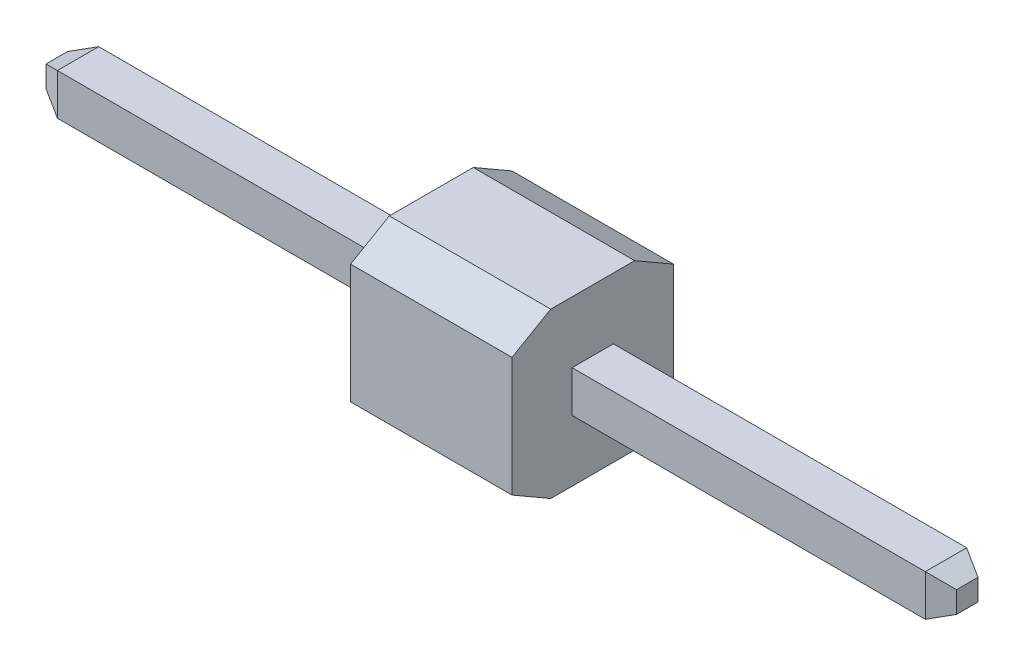
ISO-10303-21;
HEADER;
FILE_DESCRIPTION(('STEP AP214'),'2;1');
FILE_NAME('part.step','',(''),(''),'','','');
FILE_SCHEMA(('AUTOMOTIVE_DESIGN { 1 0 10303 214 1 1 1 1 }'));
ENDSEC;
DATA;
#1=APPLICATION_CONTEXT('core data for automotive mechanical design processes');
#2=APPLICATION_PROTOCOL_DEFINITION('international standard','automotive_design',2000,#1);
#3=PRODUCT_CONTEXT('',#1,'mechanical');
#4=PRODUCT('Part','Part','',(#3));
#5=PRODUCT_RELATED_PRODUCT_CATEGORY('part','',(#4));
#6=PRODUCT_DEFINITION_FORMATION('','',#4);
#7=PRODUCT_DEFINITION_CONTEXT('part definition',#1,'design');
#8=PRODUCT_DEFINITION('design','',#6,#7);
#9=PRODUCT_DEFINITION_SHAPE('','',#8);
#10=(LENGTH_UNIT() NAMED_UNIT(*) SI_UNIT(.MILLI.,.METRE.));
#11=(NAMED_UNIT(*) PLANE_ANGLE_UNIT() SI_UNIT($,.RADIAN.));
#12=(NAMED_UNIT(*) SI_UNIT($,.STERADIAN.) SOLID_ANGLE_UNIT());
#13=UNCERTAINTY_MEASURE_WITH_UNIT(LENGTH_MEASURE(1.E-05),#10,'distance_accuracy_value','');
#14=(GEOMETRIC_REPRESENTATION_CONTEXT(3) GLOBAL_UNCERTAINTY_ASSIGNED_CONTEXT((#13)) GLOBAL_UNIT_ASSIGNED_CONTEXT((#10,
#11,#12)) REPRESENTATION_CONTEXT('',''));
#15=CARTESIAN_POINT('',(0.,0.,0.));
#16=DIRECTION('',(0.,0.,1.));
#17=DIRECTION('',(1.,0.,0.));
#18=AXIS2_PLACEMENT_3D('',#15,#16,#17);
#19=CARTESIAN_POINT('',(5.42107538965371,-10.4771215871937,0.629998634255617));
#20=DIRECTION('',(1.,4.37113882867379E-08,-4.37113882867379E-08));
#21=DIRECTION('',(-4.37113882867379E-08,1.,0.));
#22=AXIS2_PLACEMENT_3D('',#19,#20,#21);
#23=PLANE('',#22);
#24=DIRECTION('',(1.59994777304463E-08,0.50000000000019,0.866025403784329));
#25=VECTOR('',#24,1.);
#26=CARTESIAN_POINT('',(5.4210752666678,-9.2335317487037,-0.940001365744382));
#27=LINE('',#26,#25);
#28=CARTESIAN_POINT('',(5.4210752666678,-9.2335317487037,-0.940001365744382));
#29=VERTEX_POINT('',#28);
#30=CARTESIAN_POINT('',(5.42107527775256,-8.8871215871937,-0.340001365744383));
#31=VERTEX_POINT('',#30);
#32=EDGE_CURVE('E11',#29,#31,#27,.T.);
#33=ORIENTED_EDGE('',*,*,#32,.T.);
#34=DIRECTION('',(4.37113886966664E-08,0.,0.999999999999999));
#35=VECTOR('',#34,1.);
#36=CARTESIAN_POINT('',(5.42107527775256,-8.8871215871937,-0.340001365744383));
#37=LINE('',#36,#35);
#38=CARTESIAN_POINT('',(5.42107533457736,-8.8871215871937,0.959998634255618));
#39=VERTEX_POINT('',#38);
#40=EDGE_CURVE('E304',#31,#39,#37,.T.);
#41=ORIENTED_EDGE('',*,*,#40,.T.);
#42=DIRECTION('',(5.97108668825761E-08,-0.500000000000186,0.86602540378433));
#43=VECTOR('',#42,1.);
#44=CARTESIAN_POINT('',(5.42107533457736,-8.8871215871937,0.959998634255618));
#45=LINE('',#44,#43);
#46=CARTESIAN_POINT('',(5.42107537594627,-9.23353174870369,1.55999863425562));
#47=VERTEX_POINT('',#46);
#48=EDGE_CURVE('E296',#39,#47,#45,.T.);
#49=ORIENTED_EDGE('',*,*,#48,.T.);
#50=DIRECTION('',(4.37113884815545E-08,-0.999999999999999,0.));
#51=VECTOR('',#50,1.);
#52=CARTESIAN_POINT('',(5.42107537594627,-9.23353174870369,1.55999863425562));
#53=LINE('',#52,#51);
#54=CARTESIAN_POINT('',(5.42107545668905,-11.0807114256737,1.55999863425562));
#55=VERTEX_POINT('',#54);
#56=EDGE_CURVE('E281',#47,#55,#53,.T.);
#57=ORIENTED_EDGE('',*,*,#56,.T.);
#58=DIRECTION('',(1.59994802942811E-08,0.500000000000192,0.866025403784328));
#59=VECTOR('',#58,1.);
#60=CARTESIAN_POINT('',(5.42107544560429,-11.4271215871937,0.959998634255618));
#61=LINE('',#60,#59);
#62=CARTESIAN_POINT('',(5.42107544560429,-11.4271215871937,0.959998634255618));
#63=VERTEX_POINT('',#62);
#64=EDGE_CURVE('E265',#63,#55,#61,.T.);
#65=ORIENTED_EDGE('',*,*,#64,.F.);
#66=DIRECTION('',(4.37113880134522E-08,0.,0.999999999999999));
#67=VECTOR('',#66,1.);
#68=CARTESIAN_POINT('',(5.42107538877949,-11.4271215871937,-0.340001365744383));
#69=LINE('',#68,#67);
#70=CARTESIAN_POINT('',(5.42107538877949,-11.4271215871937,-0.340001365744383));
#71=VERTEX_POINT('',#70);
#72=EDGE_CURVE('E248',#71,#63,#69,.T.);
#73=ORIENTED_EDGE('',*,*,#72,.F.);
#74=DIRECTION('',(5.97108656001701E-08,-0.500000000000187,0.866025403784328));
#75=VECTOR('',#74,1.);
#76=CARTESIAN_POINT('',(5.42107534741058,-11.0807114256737,-0.940001365744382));
#77=LINE('',#76,#75);
#78=CARTESIAN_POINT('',(5.42107534741058,-11.0807114256737,-0.940001365744382));
#79=VERTEX_POINT('',#78);
#80=EDGE_CURVE('E242',#79,#71,#77,.T.);
#81=ORIENTED_EDGE('',*,*,#80,.F.);
#82=DIRECTION('',(4.37113884815545E-08,-0.999999999999999,0.));
#83=VECTOR('',#82,1.);
#84=CARTESIAN_POINT('',(5.4210752666678,-9.2335317487037,-0.940001365744382));
#85=LINE('',#84,#83);
#86=EDGE_CURVE('E236',#29,#79,#85,.T.);
#87=ORIENTED_EDGE('',*,*,#86,.F.);
#88=EDGE_LOOP('',(#33,#41,#49,#57,#65,#73,#81,#87));
#89=FACE_BOUND('',#88,.T.);
#90=DIRECTION('',(-4.37113872875372E-08,0.,-0.999999999999999));
#91=VECTOR('',#90,1.);
#92=CARTESIAN_POINT('',(5.42107536167842,-9.8371215871937,0.629998634255617));
#93=LINE('',#92,#91);
#94=CARTESIAN_POINT('',(5.42107536167842,-9.8371215871937,0.629998634255617));
#95=VERTEX_POINT('',#94);
#96=CARTESIAN_POINT('',(5.42107533370314,-9.8371215871937,-0.0100013657443826));
#97=VERTEX_POINT('',#96);
#98=EDGE_CURVE('E302',#95,#97,#93,.T.);
#99=ORIENTED_EDGE('',*,*,#98,.T.);
#100=DIRECTION('',(-4.37113872875371E-08,0.999999999999999,0.));
#101=VECTOR('',#100,1.);
#102=CARTESIAN_POINT('',(5.42107536167842,-10.4771215871937,-0.0100013657443826));
#103=LINE('',#102,#101);
#104=CARTESIAN_POINT('',(5.42107536167842,-10.4771215871937,-0.0100013657443826));
#105=VERTEX_POINT('',#104);
#106=EDGE_CURVE('E293',#105,#97,#103,.T.);
#107=ORIENTED_EDGE('',*,*,#106,.F.);
#108=DIRECTION('',(-4.37113900630947E-08,0.,-0.999999999999999));
#109=VECTOR('',#108,1.);
#110=CARTESIAN_POINT('',(5.42107538965371,-10.4771215871937,0.629998634255617));
#111=LINE('',#110,#109);
#112=CARTESIAN_POINT('',(5.42107538965371,-10.4771215871937,0.629998634255617));
#113=VERTEX_POINT('',#112);
#114=EDGE_CURVE('E278',#113,#105,#111,.T.);
#115=ORIENTED_EDGE('',*,*,#114,.F.);
#116=DIRECTION('',(-4.37113900630947E-08,0.999999999999999,0.));
#117=VECTOR('',#116,1.);
#118=CARTESIAN_POINT('',(5.42107538965371,-10.4771215871937,0.629998634255617));
#119=LINE('',#118,#117);
#120=EDGE_CURVE('E263',#113,#95,#119,.T.);
#121=ORIENTED_EDGE('',*,*,#120,.T.);
#122=EDGE_LOOP('',(#99,#107,#115,#121));
#123=FACE_BOUND('',#122,.T.);
#124=ADVANCED_FACE('F17',(#89,#123),#23,.T.);
#125=CARTESIAN_POINT('',(2.92107538965371,-10.4771216964722,0.629998743534088));
#126=DIRECTION('',(1.,4.37113882867379E-08,-4.37113882867379E-08));
#127=DIRECTION('',(-4.37113882867379E-08,1.,0.));
#128=AXIS2_PLACEMENT_3D('',#125,#126,#127);
#129=PLANE('',#128);
#130=DIRECTION('',(1.59994783714339E-08,0.50000000000019,0.866025403784329));
#131=VECTOR('',#130,1.);
#132=CARTESIAN_POINT('',(2.9210752666678,-9.23353185798217,-0.940001256465912));
#133=LINE('',#132,#131);
#134=CARTESIAN_POINT('',(2.9210752666678,-9.23353185798217,-0.940001256465912));
#135=VERTEX_POINT('',#134);
#136=CARTESIAN_POINT('',(2.92107527775256,-8.88712169647217,-0.340001256465912));
#137=VERTEX_POINT('',#136);
#138=EDGE_CURVE('E24',#135,#137,#133,.T.);
#139=ORIENTED_EDGE('',*,*,#138,.F.);
#140=DIRECTION('',(4.37113882411397E-08,-0.999999999999999,0.));
#141=VECTOR('',#140,1.);
#142=CARTESIAN_POINT('',(2.9210752666678,-9.23353185798217,-0.940001256465912));
#143=LINE('',#142,#141);
#144=CARTESIAN_POINT('',(2.92107534741058,-11.0807115349522,-0.940001256465912));
#145=VERTEX_POINT('',#144);
#146=EDGE_CURVE('E300',#135,#145,#143,.T.);
#147=ORIENTED_EDGE('',*,*,#146,.T.);
#148=DIRECTION('',(5.97108668821452E-08,-0.500000000000187,0.866025403784328));
#149=VECTOR('',#148,1.);
#150=CARTESIAN_POINT('',(2.92107534741058,-11.0807115349522,-0.940001256465912));
#151=LINE('',#150,#149);
#152=CARTESIAN_POINT('',(2.92107538877949,-11.4271216964722,-0.340001256465912));
#153=VERTEX_POINT('',#152);
#154=EDGE_CURVE('E286',#145,#153,#151,.T.);
#155=ORIENTED_EDGE('',*,*,#154,.T.);
#156=DIRECTION('',(4.37113880134522E-08,0.,0.999999999999999));
#157=VECTOR('',#156,1.);
#158=CARTESIAN_POINT('',(2.92107538877949,-11.4271216964722,-0.340001256465912));
#159=LINE('',#158,#157);
#160=CARTESIAN_POINT('',(2.92107544560429,-11.4271216964722,0.959998743534088));
#161=VERTEX_POINT('',#160);
#162=EDGE_CURVE('E271',#153,#161,#159,.T.);
#163=ORIENTED_EDGE('',*,*,#162,.T.);
#164=DIRECTION('',(1.5999479012306E-08,0.500000000000192,0.866025403784328));
#165=VECTOR('',#164,1.);
#166=CARTESIAN_POINT('',(2.92107544560429,-11.4271216964722,0.959998743534088));
#167=LINE('',#166,#165);
#168=CARTESIAN_POINT('',(2.92107545668905,-11.0807115349522,1.55999874353409));
#169=VERTEX_POINT('',#168);
#170=EDGE_CURVE('E253',#161,#169,#167,.T.);
#171=ORIENTED_EDGE('',*,*,#170,.T.);
#172=DIRECTION('',(4.37113882411397E-08,-0.999999999999999,0.));
#173=VECTOR('',#172,1.);
#174=CARTESIAN_POINT('',(2.92107537594627,-9.23353185798216,1.55999874353409));
#175=LINE('',#174,#173);
#176=CARTESIAN_POINT('',(2.92107537594627,-9.23353185798216,1.55999874353409));
#177=VERTEX_POINT('',#176);
#178=EDGE_CURVE('E261',#177,#169,#175,.T.);
#179=ORIENTED_EDGE('',*,*,#178,.F.);
#180=DIRECTION('',(5.97108668825761E-08,-0.500000000000186,0.86602540378433));
#181=VECTOR('',#180,1.);
#182=CARTESIAN_POINT('',(2.92107533457736,-8.88712169647217,0.959998743534088));
#183=LINE('',#182,#181);
#184=CARTESIAN_POINT('',(2.92107533457736,-8.88712169647217,0.959998743534088));
#185=VERTEX_POINT('',#184);
#186=EDGE_CURVE('E276',#185,#177,#183,.T.);
#187=ORIENTED_EDGE('',*,*,#186,.F.);
#188=DIRECTION('',(4.37113883550593E-08,0.,0.999999999999999));
#189=VECTOR('',#188,1.);
#190=CARTESIAN_POINT('',(2.92107527775256,-8.88712169647217,-0.340001256465912));
#191=LINE('',#190,#189);
#192=EDGE_CURVE('E291',#137,#185,#191,.T.);
#193=ORIENTED_EDGE('',*,*,#192,.F.);
#194=EDGE_LOOP('',(#139,#147,#155,#163,#171,#179,#187,#193));
#195=FACE_BOUND('',#194,.T.);
#196=DIRECTION('',(-4.37113879814265E-08,0.999999999999999,0.));
#197=VECTOR('',#196,1.);
#198=CARTESIAN_POINT('',(2.92107536167842,-10.4771216964722,-0.0100012564659119));
#199=LINE('',#198,#197);
#200=CARTESIAN_POINT('',(2.92107536167842,-10.4771216964722,-0.0100012564659119));
#201=VERTEX_POINT('',#200);
#202=CARTESIAN_POINT('',(2.92107533370314,-9.83712169647217,-0.0100012564659119));
#203=VERTEX_POINT('',#202);
#204=EDGE_CURVE('E298',#201,#203,#199,.T.);
#205=ORIENTED_EDGE('',*,*,#204,.T.);
#206=DIRECTION('',(-4.37113879814266E-08,0.,-0.999999999999999));
#207=VECTOR('',#206,1.);
#208=CARTESIAN_POINT('',(2.92107536167842,-9.83712169647217,0.629998743534088));
#209=LINE('',#208,#207);
#210=CARTESIAN_POINT('',(2.92107536167842,-9.83712169647217,0.629998743534088));
#211=VERTEX_POINT('',#210);
#212=EDGE_CURVE('E283',#211,#203,#209,.T.);
#213=ORIENTED_EDGE('',*,*,#212,.F.);
#214=DIRECTION('',(-4.37113886753159E-08,0.999999999999999,0.));
#215=VECTOR('',#214,1.);
#216=CARTESIAN_POINT('',(2.92107538965371,-10.4771216964722,0.629998743534088));
#217=LINE('',#216,#215);
#218=CARTESIAN_POINT('',(2.92107538965371,-10.4771216964722,0.629998743534088));
#219=VERTEX_POINT('',#218);
#220=EDGE_CURVE('E268',#219,#211,#217,.T.);
#221=ORIENTED_EDGE('',*,*,#220,.F.);
#222=DIRECTION('',(-4.37113886753159E-08,0.,-0.999999999999999));
#223=VECTOR('',#222,1.);
#224=CARTESIAN_POINT('',(2.92107538965371,-10.4771216964722,0.629998743534088));
#225=LINE('',#224,#223);
#226=EDGE_CURVE('E251',#219,#201,#225,.T.);
#227=ORIENTED_EDGE('',*,*,#226,.T.);
#228=EDGE_LOOP('',(#205,#213,#221,#227));
#229=FACE_BOUND('',#228,.T.);
#230=ADVANCED_FACE('F314',(#195,#229),#129,.F.);
#231=CARTESIAN_POINT('',(5.4210752666678,-9.2335317487037,-0.940001365744382));
#232=DIRECTION('',(5.97108668343731E-08,-0.866025403784328,0.50000000000019));
#233=DIRECTION('',(-1.59994785476185E-08,-0.500000000000192,-0.866025403784329));
#234=AXIS2_PLACEMENT_3D('',#231,#232,#233);
#235=PLANE('',#234);
#236=ORIENTED_EDGE('',*,*,#138,.T.);
#237=DIRECTION('',(-0.999999999999998,-4.37113868656524E-08,4.37113883755557E-08));
#238=VECTOR('',#237,1.);
#239=CARTESIAN_POINT('',(5.42107527775256,-8.8871215871937,-0.340001365744383));
#240=LINE('',#239,#238);
#241=EDGE_CURVE('E288',#31,#137,#240,.T.);
#242=ORIENTED_EDGE('',*,*,#241,.F.);
#243=ORIENTED_EDGE('',*,*,#32,.F.);
#244=DIRECTION('',(-0.999999999999998,-4.37113897078233E-08,4.37113881091022E-08));
#245=VECTOR('',#244,1.);
#246=CARTESIAN_POINT('',(5.4210752666678,-9.2335317487037,-0.940001365744382));
#247=LINE('',#246,#245);
#248=EDGE_CURVE('E256',#29,#135,#247,.T.);
#249=ORIENTED_EDGE('',*,*,#248,.T.);
#250=EDGE_LOOP('',(#236,#242,#243,#249));
#251=FACE_BOUND('',#250,.T.);
#252=ADVANCED_FACE('F306',(#251),#235,.F.);
#253=CARTESIAN_POINT('',(5.42107527775256,-8.8871215871937,-0.340001365744383));
#254=DIRECTION('',(4.37113882867379E-08,-1.,0.));
#255=DIRECTION('',(1.,4.37113882867379E-08,-4.37113882867379E-08));
#256=AXIS2_PLACEMENT_3D('',#253,#254,#255);
#257=PLANE('',#256);
#258=ORIENTED_EDGE('',*,*,#192,.T.);
#259=DIRECTION('',(-0.999999999999998,-4.37113868656524E-08,4.37113882867378E-08));
#260=VECTOR('',#259,1.);
#261=CARTESIAN_POINT('',(5.42107533457736,-8.8871215871937,0.959998634255618));
#262=LINE('',#261,#260);
#263=EDGE_CURVE('E273',#39,#185,#262,.T.);
#264=ORIENTED_EDGE('',*,*,#263,.F.);
#265=ORIENTED_EDGE('',*,*,#40,.F.);
#266=ORIENTED_EDGE('',*,*,#241,.T.);
#267=EDGE_LOOP('',(#258,#264,#265,#266));
#268=FACE_BOUND('',#267,.T.);
#269=ADVANCED_FACE('F311',(#268),#257,.F.);
#270=CARTESIAN_POINT('',(5.42107533457736,-8.8871215871937,0.959998634255618));
#271=DIRECTION('',(1.59994785476185E-08,-0.86602540378433,-0.50000000000019));
#272=DIRECTION('',(-5.97108668343731E-08,0.500000000000188,-0.866025403784329));
#273=AXIS2_PLACEMENT_3D('',#270,#271,#272);
#274=PLANE('',#273);
#275=ORIENTED_EDGE('',*,*,#186,.T.);
#276=DIRECTION('',(-0.999999999999998,-4.37113897078233E-08,4.37113882867378E-08));
#277=VECTOR('',#276,1.);
#278=CARTESIAN_POINT('',(5.42107537594627,-9.23353174870369,1.55999863425562));
#279=LINE('',#278,#277);
#280=EDGE_CURVE('E258',#47,#177,#279,.T.);
#281=ORIENTED_EDGE('',*,*,#280,.F.);
#282=ORIENTED_EDGE('',*,*,#48,.F.);
#283=ORIENTED_EDGE('',*,*,#263,.T.);
#284=EDGE_LOOP('',(#275,#281,#282,#283));
#285=FACE_BOUND('',#284,.T.);
#286=ADVANCED_FACE('F319',(#285),#274,.F.);
#287=CARTESIAN_POINT('',(5.42107537594627,-9.23353174870369,1.55999863425562));
#288=DIRECTION('',(-4.37113882867379E-08,0.,-1.));
#289=DIRECTION('',(-1.,-4.37113882867379E-08,4.37113882867379E-08));
#290=AXIS2_PLACEMENT_3D('',#287,#288,#289);
#291=PLANE('',#290);
#292=ORIENTED_EDGE('',*,*,#178,.T.);
#293=DIRECTION('',(-0.999999999999998,-4.37113897078233E-08,4.37113882867378E-08));
#294=VECTOR('',#293,1.);
#295=CARTESIAN_POINT('',(5.42107545668905,-11.0807114256737,1.55999863425562));
#296=LINE('',#295,#294);
#297=EDGE_CURVE('E245',#55,#169,#296,.T.);
#298=ORIENTED_EDGE('',*,*,#297,.F.);
#299=ORIENTED_EDGE('',*,*,#56,.F.);
#300=ORIENTED_EDGE('',*,*,#280,.T.);
#301=EDGE_LOOP('',(#292,#298,#299,#300));
#302=FACE_BOUND('',#301,.T.);
#303=ADVANCED_FACE('F326',(#302),#291,.F.);
#304=CARTESIAN_POINT('',(5.42107544560429,-11.4271215871937,0.959998634255618));
#305=DIRECTION('',(5.97108668343731E-08,-0.866025403784328,0.50000000000019));
#306=DIRECTION('',(-1.59994785476185E-08,-0.500000000000192,-0.866025403784329));
#307=AXIS2_PLACEMENT_3D('',#304,#305,#306);
#308=PLANE('',#307);
#309=ORIENTED_EDGE('',*,*,#170,.F.);
#310=DIRECTION('',(-0.999999999999998,-4.37113897078233E-08,4.37113882867378E-08));
#311=VECTOR('',#310,1.);
#312=CARTESIAN_POINT('',(5.42107544560429,-11.4271215871937,0.959998634255618));
#313=LINE('',#312,#311);
#314=EDGE_CURVE('E239',#63,#161,#313,.T.);
#315=ORIENTED_EDGE('',*,*,#314,.F.);
#316=ORIENTED_EDGE('',*,*,#64,.T.);
#317=ORIENTED_EDGE('',*,*,#297,.T.);
#318=EDGE_LOOP('',(#309,#315,#316,#317));
#319=FACE_BOUND('',#318,.T.);
#320=ADVANCED_FACE('F329',(#319),#308,.T.);
#321=CARTESIAN_POINT('',(5.42107538877949,-11.4271215871937,-0.340001365744383));
#322=DIRECTION('',(4.37113882867379E-08,-1.,0.));
#323=DIRECTION('',(1.,4.37113882867379E-08,-4.37113882867379E-08));
#324=AXIS2_PLACEMENT_3D('',#321,#322,#323);
#325=PLANE('',#324);
#326=ORIENTED_EDGE('',*,*,#162,.F.);
#327=DIRECTION('',(-0.999999999999998,-4.37113897078233E-08,4.37113883755557E-08));
#328=VECTOR('',#327,1.);
#329=CARTESIAN_POINT('',(5.42107538877949,-11.4271215871937,-0.340001365744383));
#330=LINE('',#329,#328);
#331=EDGE_CURVE('E233',#71,#153,#330,.T.);
#332=ORIENTED_EDGE('',*,*,#331,.F.);
#333=ORIENTED_EDGE('',*,*,#72,.T.);
#334=ORIENTED_EDGE('',*,*,#314,.T.);
#335=EDGE_LOOP('',(#326,#332,#333,#334));
#336=FACE_BOUND('',#335,.T.);
#337=ADVANCED_FACE('F333',(#336),#325,.T.);
#338=CARTESIAN_POINT('',(5.42107534741058,-11.0807114256737,-0.940001365744382));
#339=DIRECTION('',(1.59994785476185E-08,-0.86602540378433,-0.50000000000019));
#340=DIRECTION('',(-5.97108668343731E-08,0.500000000000188,-0.866025403784329));
#341=AXIS2_PLACEMENT_3D('',#338,#339,#340);
#342=PLANE('',#341);
#343=ORIENTED_EDGE('',*,*,#154,.F.);
#344=DIRECTION('',(-0.999999999999998,-4.37113897078233E-08,4.37113881091021E-08));
#345=VECTOR('',#344,1.);
#346=CARTESIAN_POINT('',(5.42107534741058,-11.0807114256737,-0.940001365744382));
#347=LINE('',#346,#345);
#348=EDGE_CURVE('E230',#79,#145,#347,.T.);
#349=ORIENTED_EDGE('',*,*,#348,.F.);
#350=ORIENTED_EDGE('',*,*,#80,.T.);
#351=ORIENTED_EDGE('',*,*,#331,.T.);
#352=EDGE_LOOP('',(#343,#349,#350,#351));
#353=FACE_BOUND('',#352,.T.);
#354=ADVANCED_FACE('F337',(#353),#342,.T.);
#355=CARTESIAN_POINT('',(5.4210752666678,-9.2335317487037,-0.940001365744382));
#356=DIRECTION('',(-4.37113882867379E-08,0.,-1.));
#357=DIRECTION('',(-4.37113882867379E-08,1.,0.));
#358=AXIS2_PLACEMENT_3D('',#355,#356,#357);
#359=PLANE('',#358);
#360=ORIENTED_EDGE('',*,*,#146,.F.);
#361=ORIENTED_EDGE('',*,*,#248,.F.);
#362=ORIENTED_EDGE('',*,*,#86,.T.);
#363=ORIENTED_EDGE('',*,*,#348,.T.);
#364=EDGE_LOOP('',(#360,#361,#362,#363));
#365=FACE_BOUND('',#364,.T.);
#366=ADVANCED_FACE('F339',(#365),#359,.T.);
#367=CARTESIAN_POINT('',(-2.87892461034629,-10.4771219499982,0.62999899706014));
#368=DIRECTION('',(-1.,-4.37113882867379E-08,4.37113882867379E-08));
#369=DIRECTION('',(4.37113882867379E-08,-1.,0.));
#370=AXIS2_PLACEMENT_3D('',#367,#368,#369);
#371=PLANE('',#370);
#372=DIRECTION('',(4.37113927490808E-08,-0.999999999999999,0.));
#373=VECTOR('',#372,1.);
#374=CARTESIAN_POINT('',(-2.87892465284411,-9.99100347718822,0.14388052425114));
#375=LINE('',#374,#373);
#376=CARTESIAN_POINT('',(-2.87892465284411,-9.99100347718822,0.14388052425114));
#377=VERTEX_POINT('',#376);
#378=CARTESIAN_POINT('',(-2.87892463832158,-10.3232404227982,0.14388052425114));
#379=VERTEX_POINT('',#378);
#380=EDGE_CURVE('E228',#377,#379,#375,.T.);
#381=ORIENTED_EDGE('',*,*,#380,.T.);
#382=DIRECTION('',(4.37113874013716E-08,0.,0.999999999999999));
#383=VECTOR('',#382,1.);
#384=CARTESIAN_POINT('',(-2.87892463832158,-10.3232404227982,0.14388052425114));
#385=LINE('',#384,#383);
#386=CARTESIAN_POINT('',(-2.87892462379904,-10.3232404227982,0.47611746986914));
#387=VERTEX_POINT('',#386);
#388=EDGE_CURVE('E223',#379,#387,#385,.T.);
#389=ORIENTED_EDGE('',*,*,#388,.T.);
#390=DIRECTION('',(-4.37113900757526E-08,0.999999999999999,0.));
#391=VECTOR('',#390,1.);
#392=CARTESIAN_POINT('',(-2.87892462379904,-10.3232404227982,0.47611746986914));
#393=LINE('',#392,#391);
#394=CARTESIAN_POINT('',(-2.87892463832158,-9.99100347718822,0.47611746986914));
#395=VERTEX_POINT('',#394);
#396=EDGE_CURVE('E215',#387,#395,#393,.T.);
#397=ORIENTED_EDGE('',*,*,#396,.T.);
#398=DIRECTION('',(-4.37113847280434E-08,0.,-0.999999999999999));
#399=VECTOR('',#398,1.);
#400=CARTESIAN_POINT('',(-2.87892463832158,-9.99100347718822,0.47611746986914));
#401=LINE('',#400,#399);
#402=EDGE_CURVE('E207',#395,#377,#401,.T.);
#403=ORIENTED_EDGE('',*,*,#402,.T.);
#404=EDGE_LOOP('',(#381,#389,#397,#403));
#405=FACE_BOUND('',#404,.T.);
#406=ADVANCED_FACE('F341',(#405),#371,.T.);
#407=CARTESIAN_POINT('',(-2.87892461034629,-10.4771219499982,0.62999899706014));
#408=DIRECTION('',(4.37113882867379E-08,-1.,0.));
#409=DIRECTION('',(-4.37113882867379E-08,0.,-1.));
#410=AXIS2_PLACEMENT_3D('',#407,#408,#409);
#411=PLANE('',#410);
#412=DIRECTION('',(0.999999999999998,4.37113881958092E-08,-4.37113882769955E-08));
#413=VECTOR('',#412,1.);
#414=CARTESIAN_POINT('',(-2.54892461034629,-10.4771219355735,0.629998982635382));
#415=LINE('',#414,#413);
#416=CARTESIAN_POINT('',(-2.54892461034629,-10.4771219355735,0.629998982635382));
#417=VERTEX_POINT('',#416);
#418=EDGE_CURVE('E225',#417,#219,#415,.T.);
#419=ORIENTED_EDGE('',*,*,#418,.F.);
#420=DIRECTION('',(-4.37113872875372E-08,0.,-0.999999999999999));
#421=VECTOR('',#420,1.);
#422=CARTESIAN_POINT('',(-2.54892461034629,-10.4771219355735,0.629998982635382));
#423=LINE('',#422,#421);
#424=CARTESIAN_POINT('',(-2.54892463832157,-10.4771219355735,-0.010001017364618));
#425=VERTEX_POINT('',#424);
#426=EDGE_CURVE('E217',#417,#425,#423,.T.);
#427=ORIENTED_EDGE('',*,*,#426,.T.);
#428=DIRECTION('',(0.999999999999998,4.37113881958092E-08,-4.37113882161058E-08));
#429=VECTOR('',#428,1.);
#430=CARTESIAN_POINT('',(-2.54892463832157,-10.4771219355735,-0.010001017364618));
#431=LINE('',#430,#429);
#432=EDGE_CURVE('E220',#425,#201,#431,.T.);
#433=ORIENTED_EDGE('',*,*,#432,.T.);
#434=ORIENTED_EDGE('',*,*,#226,.F.);
#435=EDGE_LOOP('',(#419,#427,#433,#434));
#436=FACE_BOUND('',#435,.T.);
#437=ADVANCED_FACE('F348',(#436),#411,.T.);
#438=CARTESIAN_POINT('',(-2.87892463832158,-10.4771219499982,-0.0100010029398598));
#439=DIRECTION('',(-4.37113882867379E-08,0.,-1.));
#440=DIRECTION('',(-1.,-4.37113882867379E-08,4.37113882867379E-08));
#441=AXIS2_PLACEMENT_3D('',#438,#439,#440);
#442=PLANE('',#441);
#443=ORIENTED_EDGE('',*,*,#432,.F.);
#444=DIRECTION('',(-4.37113886753159E-08,0.999999999999999,0.));
#445=VECTOR('',#444,1.);
#446=CARTESIAN_POINT('',(-2.54892463832157,-10.4771219355735,-0.010001017364618));
#447=LINE('',#446,#445);
#448=CARTESIAN_POINT('',(-2.54892466629686,-9.83712193557346,-0.010001017364618));
#449=VERTEX_POINT('',#448);
#450=EDGE_CURVE('E209',#425,#449,#447,.T.);
#451=ORIENTED_EDGE('',*,*,#450,.T.);
#452=DIRECTION('',(0.999999999999998,4.37113907937716E-08,-4.37113882161057E-08));
#453=VECTOR('',#452,1.);
#454=CARTESIAN_POINT('',(-2.54892466629686,-9.83712193557346,-0.010001017364618));
#455=LINE('',#454,#453);
#456=EDGE_CURVE('E212',#449,#203,#455,.T.);
#457=ORIENTED_EDGE('',*,*,#456,.T.);
#458=ORIENTED_EDGE('',*,*,#204,.F.);
#459=EDGE_LOOP('',(#443,#451,#457,#458));
#460=FACE_BOUND('',#459,.T.);
#461=ADVANCED_FACE('F424',(#460),#442,.T.);
#462=CARTESIAN_POINT('',(-2.87892463832158,-9.83712194999822,0.62999899706014));
#463=DIRECTION('',(4.37113882867379E-08,-1.,0.));
#464=DIRECTION('',(-4.37113882867379E-08,0.,-1.));
#465=AXIS2_PLACEMENT_3D('',#462,#463,#464);
#466=PLANE('',#465);
#467=ORIENTED_EDGE('',*,*,#456,.F.);
#468=DIRECTION('',(4.37113900630947E-08,0.,0.999999999999999));
#469=VECTOR('',#468,1.);
#470=CARTESIAN_POINT('',(-2.54892466629686,-9.83712193557347,-0.010001017364618));
#471=LINE('',#470,#469);
#472=CARTESIAN_POINT('',(-2.54892463832157,-9.83712193557346,0.629998982635382));
#473=VERTEX_POINT('',#472);
#474=EDGE_CURVE('E201',#449,#473,#471,.T.);
#475=ORIENTED_EDGE('',*,*,#474,.T.);
#476=DIRECTION('',(0.999999999999998,4.37113907937716E-08,-4.37113882769955E-08));
#477=VECTOR('',#476,1.);
#478=CARTESIAN_POINT('',(-2.54892463832157,-9.83712193557346,0.629998982635382));
#479=LINE('',#478,#477);
#480=EDGE_CURVE('E204',#473,#211,#479,.T.);
#481=ORIENTED_EDGE('',*,*,#480,.T.);
#482=ORIENTED_EDGE('',*,*,#212,.T.);
#483=EDGE_LOOP('',(#467,#475,#481,#482));
#484=FACE_BOUND('',#483,.T.);
#485=ADVANCED_FACE('F421',(#484),#466,.F.);
#486=CARTESIAN_POINT('',(-2.87892461034629,-10.4771219499982,0.62999899706014));
#487=DIRECTION('',(-4.37113882867379E-08,0.,-1.));
#488=DIRECTION('',(-1.,-4.37113882867379E-08,4.37113882867379E-08));
#489=AXIS2_PLACEMENT_3D('',#486,#487,#488);
#490=PLANE('',#489);
#491=ORIENTED_EDGE('',*,*,#480,.F.);
#492=DIRECTION('',(4.37113858997586E-08,-0.999999999999999,0.));
#493=VECTOR('',#492,1.);
#494=CARTESIAN_POINT('',(-2.54892463832157,-9.83712193557346,0.629998982635382));
#495=LINE('',#494,#493);
#496=EDGE_CURVE('E196',#473,#417,#495,.T.);
#497=ORIENTED_EDGE('',*,*,#496,.T.);
#498=ORIENTED_EDGE('',*,*,#418,.T.);
#499=ORIENTED_EDGE('',*,*,#220,.T.);
#500=EDGE_LOOP('',(#491,#497,#498,#499));
#501=FACE_BOUND('',#500,.T.);
#502=ADVANCED_FACE('F376',(#501),#490,.F.);
#503=CARTESIAN_POINT('',(-2.87892461034629,-10.4771219499982,0.62999899706014));
#504=DIRECTION('',(-4.37113882867379E-08,0.,-1.));
#505=DIRECTION('',(-1.,-4.37113882867379E-08,4.37113882867379E-08));
#506=AXIS2_PLACEMENT_3D('',#503,#504,#505);
#507=PLANE('',#506);
#508=DIRECTION('',(0.999999999999998,4.37113829998842E-08,-4.37113882769955E-08));
#509=VECTOR('',#508,1.);
#510=CARTESIAN_POINT('',(5.42107538965371,-10.4771215871937,0.629998634255617));
#511=LINE('',#510,#509);
#512=CARTESIAN_POINT('',(10.8910753896537,-10.4771213480924,0.629998395154324));
#513=VERTEX_POINT('',#512);
#514=EDGE_CURVE('E199',#113,#513,#511,.T.);
#515=ORIENTED_EDGE('',*,*,#514,.T.);
#516=DIRECTION('',(-4.37113872875371E-08,0.999999999999999,0.));
#517=VECTOR('',#516,1.);
#518=CARTESIAN_POINT('',(10.8910753896537,-10.4771213480924,0.629998395154324));
#519=LINE('',#518,#517);
#520=CARTESIAN_POINT('',(10.8910753616784,-9.8371213480924,0.629998395154324));
#521=VERTEX_POINT('',#520);
#522=EDGE_CURVE('E191',#513,#521,#519,.T.);
#523=ORIENTED_EDGE('',*,*,#522,.T.);
#524=DIRECTION('',(0.999999999999998,4.37113933917341E-08,-4.37113882769955E-08));
#525=VECTOR('',#524,1.);
#526=CARTESIAN_POINT('',(5.42107536167842,-9.8371215871937,0.629998634255617));
#527=LINE('',#526,#525);
#528=EDGE_CURVE('E194',#95,#521,#527,.T.);
#529=ORIENTED_EDGE('',*,*,#528,.F.);
#530=ORIENTED_EDGE('',*,*,#120,.F.);
#531=EDGE_LOOP('',(#515,#523,#529,#530));
#532=FACE_BOUND('',#531,.T.);
#533=ADVANCED_FACE('F367',(#532),#507,.F.);
#534=CARTESIAN_POINT('',(-2.87892463832158,-9.83712194999822,0.62999899706014));
#535=DIRECTION('',(4.37113882867379E-08,-1.,0.));
#536=DIRECTION('',(-4.37113882867379E-08,0.,-1.));
#537=AXIS2_PLACEMENT_3D('',#534,#535,#536);
#538=PLANE('',#537);
#539=ORIENTED_EDGE('',*,*,#528,.T.);
#540=DIRECTION('',(-4.37113900630947E-08,0.,-0.999999999999999));
#541=VECTOR('',#540,1.);
#542=CARTESIAN_POINT('',(10.8910753616784,-9.8371213480924,0.629998395154324));
#543=LINE('',#542,#541);
#544=CARTESIAN_POINT('',(10.8910753337031,-9.8371213480924,-0.0100016048456765));
#545=VERTEX_POINT('',#544);
#546=EDGE_CURVE('E186',#521,#545,#543,.T.);
#547=ORIENTED_EDGE('',*,*,#546,.T.);
#548=DIRECTION('',(0.999999999999998,4.37113933917341E-08,-4.37113881146228E-08));
#549=VECTOR('',#548,1.);
#550=CARTESIAN_POINT('',(5.42107533370314,-9.8371215871937,-0.0100013657443823));
#551=LINE('',#550,#549);
#552=EDGE_CURVE('E189',#97,#545,#551,.T.);
#553=ORIENTED_EDGE('',*,*,#552,.F.);
#554=ORIENTED_EDGE('',*,*,#98,.F.);
#555=EDGE_LOOP('',(#539,#547,#553,#554));
#556=FACE_BOUND('',#555,.T.);
#557=ADVANCED_FACE('F364',(#556),#538,.F.);
#558=CARTESIAN_POINT('',(-2.87892463832158,-10.4771219499982,-0.0100010029398598));
#559=DIRECTION('',(-4.37113882867379E-08,0.,-1.));
#560=DIRECTION('',(-1.,-4.37113882867379E-08,4.37113882867379E-08));
#561=AXIS2_PLACEMENT_3D('',#558,#559,#560);
#562=PLANE('',#561);
#563=ORIENTED_EDGE('',*,*,#552,.T.);
#564=DIRECTION('',(4.37113900630949E-08,-0.999999999999999,0.));
#565=VECTOR('',#564,1.);
#566=CARTESIAN_POINT('',(10.8910753337031,-9.83712134809241,-0.0100016048456764));
#567=LINE('',#566,#565);
#568=CARTESIAN_POINT('',(10.8910753616784,-10.4771213480924,-0.0100016048456765));
#569=VERTEX_POINT('',#568);
#570=EDGE_CURVE('E176',#545,#569,#567,.T.);
#571=ORIENTED_EDGE('',*,*,#570,.T.);
#572=DIRECTION('',(0.999999999999998,4.37113829998842E-08,-4.37113881146228E-08));
#573=VECTOR('',#572,1.);
#574=CARTESIAN_POINT('',(5.42107536167842,-10.4771215871937,-0.0100013657443823));
#575=LINE('',#574,#573);
#576=EDGE_CURVE('E179',#105,#569,#575,.T.);
#577=ORIENTED_EDGE('',*,*,#576,.F.);
#578=ORIENTED_EDGE('',*,*,#106,.T.);
#579=EDGE_LOOP('',(#563,#571,#577,#578));
#580=FACE_BOUND('',#579,.T.);
#581=ADVANCED_FACE('F366',(#580),#562,.T.);
#582=CARTESIAN_POINT('',(-2.87892461034629,-10.4771219499982,0.62999899706014));
#583=DIRECTION('',(4.37113882867379E-08,-1.,0.));
#584=DIRECTION('',(-4.37113882867379E-08,0.,-1.));
#585=AXIS2_PLACEMENT_3D('',#582,#583,#584);
#586=PLANE('',#585);
#587=ORIENTED_EDGE('',*,*,#576,.T.);
#588=DIRECTION('',(4.37113872875372E-08,0.,0.999999999999999));
#589=VECTOR('',#588,1.);
#590=CARTESIAN_POINT('',(10.8910753616784,-10.4771213480924,-0.0100016048456765));
#591=LINE('',#590,#589);
#592=EDGE_CURVE('E167',#569,#513,#591,.T.);
#593=ORIENTED_EDGE('',*,*,#592,.T.);
#594=ORIENTED_EDGE('',*,*,#514,.F.);
#595=ORIENTED_EDGE('',*,*,#114,.T.);
#596=EDGE_LOOP('',(#587,#593,#594,#595));
#597=FACE_BOUND('',#596,.T.);
#598=ADVANCED_FACE('F373',(#597),#586,.T.);
#599=CARTESIAN_POINT('',(11.2210753896537,-10.4771213336676,0.629998380729565));
#600=DIRECTION('',(-1.,-4.37113882867379E-08,4.37113882867379E-08));
#601=DIRECTION('',(4.37113882867379E-08,-1.,0.));
#602=AXIS2_PLACEMENT_3D('',#599,#600,#601);
#603=PLANE('',#602);
#604=DIRECTION('',(-4.37113874024243E-08,0.999999999999999,0.));
#605=VECTOR('',#604,1.);
#606=CARTESIAN_POINT('',(11.2210753616784,-10.3232398064676,0.143879907920565));
#607=LINE('',#606,#605);
#608=CARTESIAN_POINT('',(11.2210753616784,-10.3232398064676,0.143879907920565));
#609=VERTEX_POINT('',#608);
#610=CARTESIAN_POINT('',(11.2210753471559,-9.99100286085764,0.143879907920565));
#611=VERTEX_POINT('',#610);
#612=EDGE_CURVE('E153',#609,#611,#607,.T.);
#613=ORIENTED_EDGE('',*,*,#612,.T.);
#614=DIRECTION('',(4.37113874013716E-08,0.,0.999999999999999));
#615=VECTOR('',#614,1.);
#616=CARTESIAN_POINT('',(11.2210753471559,-9.99100286085765,0.143879907920565));
#617=LINE('',#616,#615);
#618=CARTESIAN_POINT('',(11.2210753616784,-9.99100286085764,0.476116853538565));
#619=VERTEX_POINT('',#618);
#620=EDGE_CURVE('E395',#611,#619,#617,.T.);
#621=ORIENTED_EDGE('',*,*,#620,.T.);
#622=DIRECTION('',(4.37113874024243E-08,-0.999999999999999,0.));
#623=VECTOR('',#622,1.);
#624=CARTESIAN_POINT('',(11.2210753616784,-9.99100286085764,0.476116853538565));
#625=LINE('',#624,#623);
#626=CARTESIAN_POINT('',(11.221075376201,-10.3232398064676,0.476116853538565));
#627=VERTEX_POINT('',#626);
#628=EDGE_CURVE('E156',#619,#627,#625,.T.);
#629=ORIENTED_EDGE('',*,*,#628,.T.);
#630=DIRECTION('',(-4.37113927480282E-08,0.,-0.999999999999999));
#631=VECTOR('',#630,1.);
#632=CARTESIAN_POINT('',(11.221075376201,-10.3232398064676,0.476116853538565));
#633=LINE('',#632,#631);
#634=EDGE_CURVE('E149',#627,#609,#633,.T.);
#635=ORIENTED_EDGE('',*,*,#634,.T.);
#636=EDGE_LOOP('',(#613,#621,#629,#635));
#637=FACE_BOUND('',#636,.T.);
#638=ADVANCED_FACE('F151',(#637),#603,.F.);
#639=CARTESIAN_POINT('',(-2.8789246315952,-9.99100347718822,0.62999899706014));
#640=DIRECTION('',(-0.422618301356784,0.906307768563367,1.84732310895534E-08));
#641=DIRECTION('',(4.37113882867379E-08,0.,1.));
#642=AXIS2_PLACEMENT_3D('',#639,#640,#641);
#643=PLANE('',#642);
#644=DIRECTION('',(0.834817095446925,0.38928165712602,-0.389281657126018));
#645=VECTOR('',#644,1.);
#646=CARTESIAN_POINT('',(-2.87892465284413,-9.9910034771877,0.143880524251623));
#647=LINE('',#646,#645);
#648=EDGE_CURVE('E181',#377,#449,#647,.T.);
#649=ORIENTED_EDGE('',*,*,#648,.F.);
#650=ORIENTED_EDGE('',*,*,#402,.F.);
#651=DIRECTION('',(-0.834817129479007,-0.389281657126019,-0.389281584143986));
#652=VECTOR('',#651,1.);
#653=CARTESIAN_POINT('',(-2.548924638322,-9.837121935572,0.629998982634844));
#654=LINE('',#653,#652);
#655=EDGE_CURVE('E404',#473,#395,#654,.T.);
#656=ORIENTED_EDGE('',*,*,#655,.F.);
#657=ORIENTED_EDGE('',*,*,#474,.F.);
#658=EDGE_LOOP('',(#649,#650,#656,#657));
#659=FACE_BOUND('',#658,.T.);
#660=ADVANCED_FACE('F418',(#659),#643,.T.);
#661=CARTESIAN_POINT('',(-2.87892461707266,-10.4771219499982,0.47611746986914));
#662=DIRECTION('',(-0.422618222124841,-1.84732292043498E-08,0.906307805509828));
#663=DIRECTION('',(4.37113882867379E-08,-1.,0.));
#664=AXIS2_PLACEMENT_3D('',#661,#662,#663);
#665=PLANE('',#664);
#666=ORIENTED_EDGE('',*,*,#655,.T.);
#667=ORIENTED_EDGE('',*,*,#396,.F.);
#668=DIRECTION('',(-0.834817163511087,0.389281584143985,-0.389281584143987));
#669=VECTOR('',#668,1.);
#670=CARTESIAN_POINT('',(-2.54892461034514,-10.4771219355707,0.629998982635654));
#671=LINE('',#670,#669);
#672=EDGE_CURVE('E160',#417,#387,#671,.T.);
#673=ORIENTED_EDGE('',*,*,#672,.F.);
#674=ORIENTED_EDGE('',*,*,#496,.F.);
#675=EDGE_LOOP('',(#666,#667,#673,#674));
#676=FACE_BOUND('',#675,.T.);
#677=ADVANCED_FACE('F434',(#676),#665,.T.);
#678=CARTESIAN_POINT('',(-2.54892463832157,-10.4771219355735,-0.010001017364618));
#679=DIRECTION('',(0.422618301356784,1.8473232667688E-08,0.906307768563367));
#680=DIRECTION('',(-4.37113882867379E-08,1.,0.));
#681=AXIS2_PLACEMENT_3D('',#678,#679,#680);
#682=PLANE('',#681);
#683=ORIENTED_EDGE('',*,*,#648,.T.);
#684=ORIENTED_EDGE('',*,*,#450,.F.);
#685=DIRECTION('',(0.834817129479008,-0.389281584143985,-0.389281657126018));
#686=VECTOR('',#685,1.);
#687=CARTESIAN_POINT('',(-2.87892463832441,-10.3232404228058,0.1438805242526));
#688=LINE('',#687,#686);
#689=EDGE_CURVE('E170',#379,#425,#688,.T.);
#690=ORIENTED_EDGE('',*,*,#689,.F.);
#691=ORIENTED_EDGE('',*,*,#380,.F.);
#692=EDGE_LOOP('',(#683,#684,#690,#691));
#693=FACE_BOUND('',#692,.T.);
#694=ADVANCED_FACE('F413',(#693),#682,.F.);
#695=CARTESIAN_POINT('',(-2.54892461034629,-10.4771219355735,0.629998982635382));
#696=DIRECTION('',(0.422618222124841,0.906307805509828,-1.84732308250282E-08));
#697=DIRECTION('',(-4.37113882867379E-08,0.,-1.));
#698=AXIS2_PLACEMENT_3D('',#695,#696,#697);
#699=PLANE('',#698);
#700=ORIENTED_EDGE('',*,*,#672,.T.);
#701=ORIENTED_EDGE('',*,*,#388,.F.);
#702=ORIENTED_EDGE('',*,*,#689,.T.);
#703=ORIENTED_EDGE('',*,*,#426,.F.);
#704=EDGE_LOOP('',(#700,#701,#702,#703));
#705=FACE_BOUND('',#704,.T.);
#706=ADVANCED_FACE('F429',(#705),#699,.F.);
#707=CARTESIAN_POINT('',(11.2210753829273,-10.3232398064676,0.629998380729565));
#708=DIRECTION('',(0.422618301356784,-0.906307768563367,-1.84732310470096E-08));
#709=DIRECTION('',(4.37113882867379E-08,0.,1.));
#710=AXIS2_PLACEMENT_3D('',#707,#708,#709);
#711=PLANE('',#710);
#712=DIRECTION('',(-0.834817129479003,-0.389281657126027,-0.389281584143988));
#713=VECTOR('',#712,1.);
#714=CARTESIAN_POINT('',(11.2210753616784,-10.3232398064682,0.143879907921048));
#715=LINE('',#714,#713);
#716=EDGE_CURVE('E164',#609,#569,#715,.T.);
#717=ORIENTED_EDGE('',*,*,#716,.F.);
#718=ORIENTED_EDGE('',*,*,#634,.F.);
#719=DIRECTION('',(0.834817095446923,0.389281657126025,-0.389281657126018));
#720=VECTOR('',#719,1.);
#721=CARTESIAN_POINT('',(10.8910753896537,-10.4771213480924,0.629998395154324));
#722=LINE('',#721,#720);
#723=EDGE_CURVE('E392',#513,#627,#722,.T.);
#724=ORIENTED_EDGE('',*,*,#723,.F.);
#725=ORIENTED_EDGE('',*,*,#592,.F.);
#726=EDGE_LOOP('',(#717,#718,#724,#725));
#727=FACE_BOUND('',#726,.T.);
#728=ADVANCED_FACE('F165',(#727),#711,.T.);
#729=CARTESIAN_POINT('',(10.8910753896537,-10.4771213480924,0.629998395154324));
#730=DIRECTION('',(-0.422618301356784,-1.8473232667688E-08,-0.906307768563367));
#731=DIRECTION('',(-4.37113882867379E-08,1.,0.));
#732=AXIS2_PLACEMENT_3D('',#729,#730,#731);
#733=PLANE('',#732);
#734=ORIENTED_EDGE('',*,*,#723,.T.);
#735=ORIENTED_EDGE('',*,*,#628,.F.);
#736=DIRECTION('',(0.834817129479006,-0.389281584143989,-0.38928165712602));
#737=VECTOR('',#736,1.);
#738=CARTESIAN_POINT('',(10.89107536168,-9.8371213480882,0.629998395153421));
#739=LINE('',#738,#737);
#740=EDGE_CURVE('E389',#521,#619,#739,.T.);
#741=ORIENTED_EDGE('',*,*,#740,.F.);
#742=ORIENTED_EDGE('',*,*,#522,.F.);
#743=EDGE_LOOP('',(#734,#735,#741,#742));
#744=FACE_BOUND('',#743,.T.);
#745=ADVANCED_FACE('F390',(#744),#733,.F.);
#746=CARTESIAN_POINT('',(11.2210753684048,-10.4771213336676,0.143879907920565));
#747=DIRECTION('',(0.422618222124841,1.84732292043498E-08,-0.906307805509828));
#748=DIRECTION('',(4.37113882867379E-08,-1.,0.));
#749=AXIS2_PLACEMENT_3D('',#746,#747,#748);
#750=PLANE('',#749);
#751=ORIENTED_EDGE('',*,*,#716,.T.);
#752=ORIENTED_EDGE('',*,*,#570,.F.);
#753=DIRECTION('',(-0.834817163511088,0.389281584143981,-0.389281584143989));
#754=VECTOR('',#753,1.);
#755=CARTESIAN_POINT('',(11.2210753471559,-9.99100286085713,0.143879907921048));
#756=LINE('',#755,#754);
#757=EDGE_CURVE('E175',#611,#545,#756,.T.);
#758=ORIENTED_EDGE('',*,*,#757,.F.);
#759=ORIENTED_EDGE('',*,*,#612,.F.);
#760=EDGE_LOOP('',(#751,#752,#758,#759));
#761=FACE_BOUND('',#760,.T.);
#762=ADVANCED_FACE('F173',(#761),#750,.T.);
#763=CARTESIAN_POINT('',(10.8910753616784,-9.8371213480924,0.629998395154324));
#764=DIRECTION('',(-0.422618222124841,-0.906307805509828,1.84732307824844E-08));
#765=DIRECTION('',(-4.37113882867379E-08,0.,-1.));
#766=AXIS2_PLACEMENT_3D('',#763,#764,#765);
#767=PLANE('',#766);
#768=ORIENTED_EDGE('',*,*,#740,.T.);
#769=ORIENTED_EDGE('',*,*,#620,.F.);
#770=ORIENTED_EDGE('',*,*,#757,.T.);
#771=ORIENTED_EDGE('',*,*,#546,.F.);
#772=EDGE_LOOP('',(#768,#769,#770,#771));
#773=FACE_BOUND('',#772,.T.);
#774=ADVANCED_FACE('F394',(#773),#767,.F.);
#775=CLOSED_SHELL('',(#124,#230,#252,#269,#286,#303,#320,#337,#354,#366,#406,#437,#461,#485,
#502,#533,#557,#581,#598,#638,#660,#677,#694,#706,#728,#745,#762,#774));
#776=MANIFOLD_SOLID_BREP('B1',#775);
#777=ADVANCED_BREP_SHAPE_REPRESENTATION('',(#18,#776),#14);
#778=SHAPE_DEFINITION_REPRESENTATION(#9,#777);
ENDSEC;
END-ISO-10303-21;
